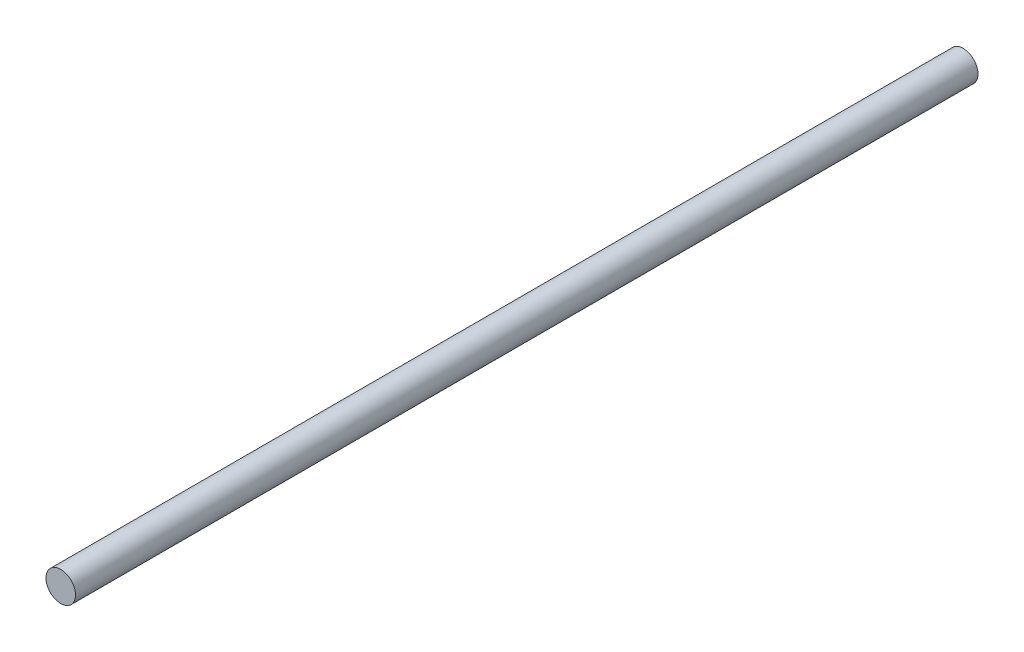
ISO-10303-21;
HEADER;
FILE_DESCRIPTION(('STEP AP214'),'2;1');
FILE_NAME('part.step','',(''),(''),'','','');
FILE_SCHEMA(('AUTOMOTIVE_DESIGN { 1 0 10303 214 1 1 1 1 }'));
ENDSEC;
DATA;
#1=APPLICATION_CONTEXT('core data for automotive mechanical design processes');
#2=APPLICATION_PROTOCOL_DEFINITION('international standard','automotive_design',2000,#1);
#3=PRODUCT_CONTEXT('',#1,'mechanical');
#4=PRODUCT('Part','Part','',(#3));
#5=PRODUCT_RELATED_PRODUCT_CATEGORY('part','',(#4));
#6=PRODUCT_DEFINITION_FORMATION('','',#4);
#7=PRODUCT_DEFINITION_CONTEXT('part definition',#1,'design');
#8=PRODUCT_DEFINITION('design','',#6,#7);
#9=PRODUCT_DEFINITION_SHAPE('','',#8);
#10=(LENGTH_UNIT() NAMED_UNIT(*) SI_UNIT(.MILLI.,.METRE.));
#11=(NAMED_UNIT(*) PLANE_ANGLE_UNIT() SI_UNIT($,.RADIAN.));
#12=(NAMED_UNIT(*) SI_UNIT($,.STERADIAN.) SOLID_ANGLE_UNIT());
#13=UNCERTAINTY_MEASURE_WITH_UNIT(LENGTH_MEASURE(1.E-05),#10,'distance_accuracy_value','');
#14=(GEOMETRIC_REPRESENTATION_CONTEXT(3) GLOBAL_UNCERTAINTY_ASSIGNED_CONTEXT((#13)) GLOBAL_UNIT_ASSIGNED_CONTEXT((#10,
#11,#12)) REPRESENTATION_CONTEXT('',''));
#15=CARTESIAN_POINT('',(0.,0.,0.));
#16=DIRECTION('',(0.,0.,1.));
#17=DIRECTION('',(1.,0.,0.));
#18=AXIS2_PLACEMENT_3D('',#15,#16,#17);
#19=CARTESIAN_POINT('',(0.,0.,30.5));
#20=DIRECTION('',(0.,0.,-1.));
#21=DIRECTION('',(-1.,0.,0.));
#22=AXIS2_PLACEMENT_3D('',#19,#20,#21);
#23=CYLINDRICAL_SURFACE('',#22,0.5);
#24=CARTESIAN_POINT('',(0.,0.,30.5));
#25=DIRECTION('',(0.,0.,1.));
#26=DIRECTION('',(1.,0.,0.));
#27=AXIS2_PLACEMENT_3D('',#24,#25,#26);
#28=CIRCLE('',#27,0.5);
#29=CARTESIAN_POINT('',(0.5,0.,30.5));
#30=VERTEX_POINT('',#29);
#31=EDGE_CURVE('E10',#30,#30,#28,.T.);
#32=ORIENTED_EDGE('',*,*,#31,.F.);
#33=EDGE_LOOP('',(#32));
#34=FACE_BOUND('',#33,.T.);
#35=CARTESIAN_POINT('',(0.,0.,0.));
#36=DIRECTION('',(0.,0.,1.));
#37=DIRECTION('',(1.,0.,0.));
#38=AXIS2_PLACEMENT_3D('',#35,#36,#37);
#39=CIRCLE('',#38,0.5);
#40=CARTESIAN_POINT('',(0.5,0.,0.));
#41=VERTEX_POINT('',#40);
#42=EDGE_CURVE('E31',#41,#41,#39,.T.);
#43=ORIENTED_EDGE('',*,*,#42,.T.);
#44=EDGE_LOOP('',(#43));
#45=FACE_BOUND('',#44,.T.);
#46=ADVANCED_FACE('F28',(#34,#45),#23,.T.);
#47=CARTESIAN_POINT('',(0.,0.,30.5));
#48=DIRECTION('',(0.,0.,1.));
#49=DIRECTION('',(1.,0.,0.));
#50=AXIS2_PLACEMENT_3D('',#47,#48,#49);
#51=PLANE('',#50);
#52=ORIENTED_EDGE('',*,*,#31,.T.);
#53=EDGE_LOOP('',(#52));
#54=FACE_BOUND('',#53,.T.);
#55=ADVANCED_FACE('F43',(#54),#51,.T.);
#56=CARTESIAN_POINT('',(0.,0.,0.));
#57=DIRECTION('',(0.,0.,1.));
#58=DIRECTION('',(1.,0.,0.));
#59=AXIS2_PLACEMENT_3D('',#56,#57,#58);
#60=PLANE('',#59);
#61=ORIENTED_EDGE('',*,*,#42,.F.);
#62=EDGE_LOOP('',(#61));
#63=FACE_BOUND('',#62,.T.);
#64=ADVANCED_FACE('F41',(#63),#60,.F.);
#65=CLOSED_SHELL('',(#46,#55,#64));
#66=MANIFOLD_SOLID_BREP('B2',#65);
#67=ADVANCED_BREP_SHAPE_REPRESENTATION('',(#18,#66),#14);
#68=SHAPE_DEFINITION_REPRESENTATION(#9,#67);
ENDSEC;
END-ISO-10303-21;
